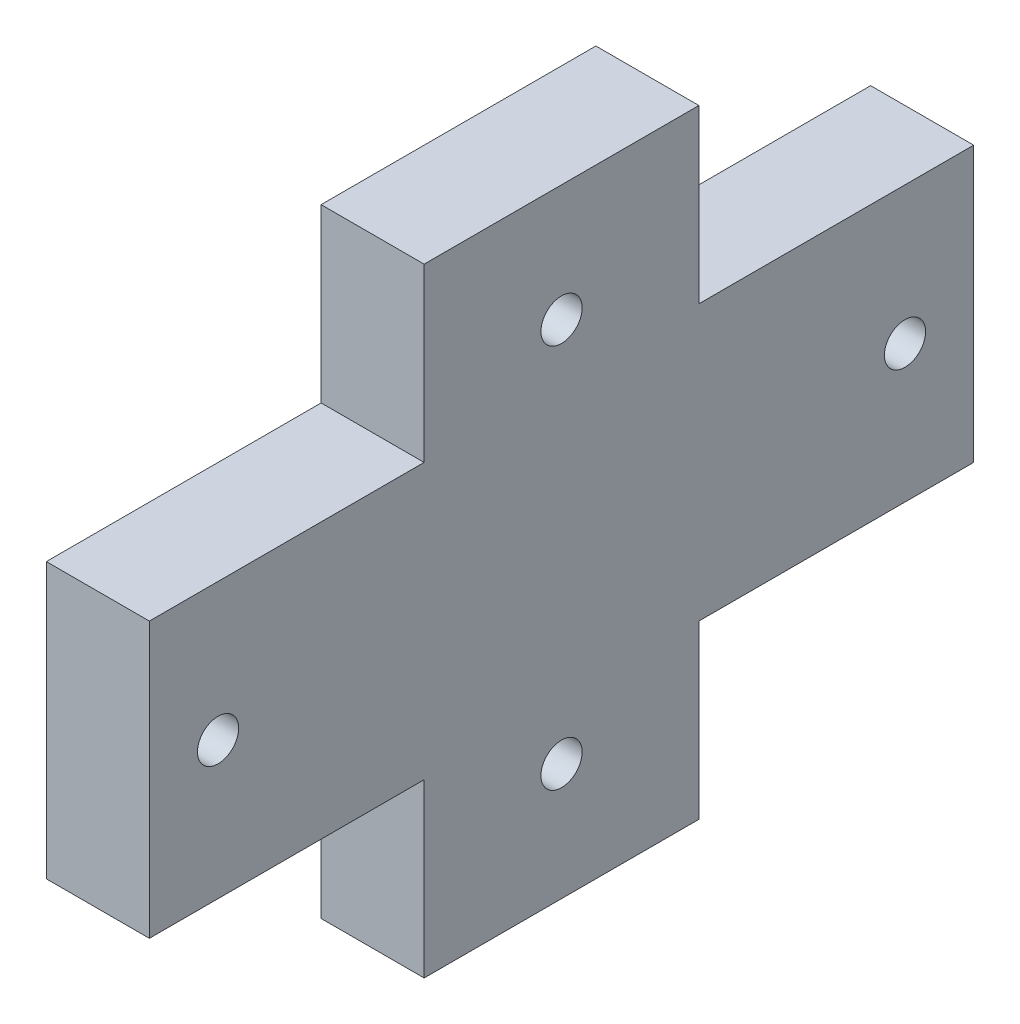
ISO-10303-21;
HEADER;
FILE_DESCRIPTION(('STEP AP214'),'2;1');
FILE_NAME('part.step','',(''),(''),'','','');
FILE_SCHEMA(('AUTOMOTIVE_DESIGN { 1 0 10303 214 1 1 1 1 }'));
ENDSEC;
DATA;
#1=APPLICATION_CONTEXT('core data for automotive mechanical design processes');
#2=APPLICATION_PROTOCOL_DEFINITION('international standard','automotive_design',2000,#1);
#3=PRODUCT_CONTEXT('',#1,'mechanical');
#4=PRODUCT('Part','Part','',(#3));
#5=PRODUCT_RELATED_PRODUCT_CATEGORY('part','',(#4));
#6=PRODUCT_DEFINITION_FORMATION('','',#4);
#7=PRODUCT_DEFINITION_CONTEXT('part definition',#1,'design');
#8=PRODUCT_DEFINITION('design','',#6,#7);
#9=PRODUCT_DEFINITION_SHAPE('','',#8);
#10=(LENGTH_UNIT() NAMED_UNIT(*) SI_UNIT(.MILLI.,.METRE.));
#11=(NAMED_UNIT(*) PLANE_ANGLE_UNIT() SI_UNIT($,.RADIAN.));
#12=(NAMED_UNIT(*) SI_UNIT($,.STERADIAN.) SOLID_ANGLE_UNIT());
#13=UNCERTAINTY_MEASURE_WITH_UNIT(LENGTH_MEASURE(1.E-05),#10,'distance_accuracy_value','');
#14=(GEOMETRIC_REPRESENTATION_CONTEXT(3) GLOBAL_UNCERTAINTY_ASSIGNED_CONTEXT((#13)) GLOBAL_UNIT_ASSIGNED_CONTEXT((#10,
#11,#12)) REPRESENTATION_CONTEXT('',''));
#15=CARTESIAN_POINT('',(0.,0.,0.));
#16=DIRECTION('',(0.,0.,1.));
#17=DIRECTION('',(1.,0.,0.));
#18=AXIS2_PLACEMENT_3D('',#15,#16,#17);
#19=CARTESIAN_POINT('',(200.,0.,0.));
#20=DIRECTION('',(-1.,0.,0.));
#21=DIRECTION('',(0.,0.,1.));
#22=AXIS2_PLACEMENT_3D('',#19,#20,#21);
#23=PLANE('',#22);
#24=CARTESIAN_POINT('',(200.,38.,0.));
#25=DIRECTION('',(1.,0.,0.));
#26=DIRECTION('',(0.,0.,1.));
#27=AXIS2_PLACEMENT_3D('',#24,#25,#26);
#28=CIRCLE('',#27,7.5);
#29=CARTESIAN_POINT('',(200.,38.,7.5));
#30=VERTEX_POINT('',#29);
#31=EDGE_CURVE('E214',#30,#30,#28,.T.);
#32=ORIENTED_EDGE('',*,*,#31,.T.);
#33=EDGE_LOOP('',(#32));
#34=FACE_BOUND('',#33,.T.);
#35=CARTESIAN_POINT('',(200.,10.,50.));
#36=DIRECTION('',(1.,0.,0.));
#37=DIRECTION('',(0.,0.,-1.));
#38=AXIS2_PLACEMENT_3D('',#35,#36,#37);
#39=CIRCLE('',#38,7.5);
#40=CARTESIAN_POINT('',(200.,10.,42.5));
#41=VERTEX_POINT('',#40);
#42=EDGE_CURVE('E202',#41,#41,#39,.T.);
#43=ORIENTED_EDGE('',*,*,#42,.T.);
#44=EDGE_LOOP('',(#43));
#45=FACE_BOUND('',#44,.T.);
#46=CARTESIAN_POINT('',(200.,10.,-50.));
#47=DIRECTION('',(-1.,0.,0.));
#48=DIRECTION('',(0.,0.,1.));
#49=AXIS2_PLACEMENT_3D('',#46,#47,#48);
#50=CIRCLE('',#49,7.5);
#51=CARTESIAN_POINT('',(200.,10.,-42.5));
#52=VERTEX_POINT('',#51);
#53=EDGE_CURVE('E190',#52,#52,#50,.T.);
#54=ORIENTED_EDGE('',*,*,#53,.F.);
#55=EDGE_LOOP('',(#54));
#56=FACE_BOUND('',#55,.T.);
#57=CARTESIAN_POINT('',(200.,-18.,0.));
#58=DIRECTION('',(-1.,0.,0.));
#59=DIRECTION('',(0.,0.,1.));
#60=AXIS2_PLACEMENT_3D('',#57,#58,#59);
#61=CIRCLE('',#60,7.5);
#62=CARTESIAN_POINT('',(200.,-18.,7.5));
#63=VERTEX_POINT('',#62);
#64=EDGE_CURVE('E178',#63,#63,#61,.T.);
#65=ORIENTED_EDGE('',*,*,#64,.F.);
#66=EDGE_LOOP('',(#65));
#67=FACE_BOUND('',#66,.T.);
#68=DIRECTION('',(0.,-1.,0.));
#69=VECTOR('',#68,1.);
#70=CARTESIAN_POINT('',(200.,20.,60.));
#71=LINE('',#70,#69);
#72=CARTESIAN_POINT('',(200.,30.,60.));
#73=VERTEX_POINT('',#72);
#74=CARTESIAN_POINT('',(200.,-10.,60.));
#75=VERTEX_POINT('',#74);
#76=EDGE_CURVE('E291',#73,#75,#71,.T.);
#77=ORIENTED_EDGE('',*,*,#76,.F.);
#78=DIRECTION('',(0.,0.,-1.));
#79=VECTOR('',#78,1.);
#80=CARTESIAN_POINT('',(200.,30.,60.));
#81=LINE('',#80,#79);
#82=CARTESIAN_POINT('',(200.,30.,20.));
#83=VERTEX_POINT('',#82);
#84=EDGE_CURVE('E161',#73,#83,#81,.T.);
#85=ORIENTED_EDGE('',*,*,#84,.T.);
#86=DIRECTION('',(0.,-1.,0.));
#87=VECTOR('',#86,1.);
#88=CARTESIAN_POINT('',(200.,55.,20.));
#89=LINE('',#88,#87);
#90=CARTESIAN_POINT('',(200.,55.,20.));
#91=VERTEX_POINT('',#90);
#92=EDGE_CURVE('E165',#91,#83,#89,.T.);
#93=ORIENTED_EDGE('',*,*,#92,.F.);
#94=DIRECTION('',(0.,0.,-1.));
#95=VECTOR('',#94,1.);
#96=CARTESIAN_POINT('',(200.,55.,20.));
#97=LINE('',#96,#95);
#98=CARTESIAN_POINT('',(200.,55.,-20.));
#99=VERTEX_POINT('',#98);
#100=EDGE_CURVE('E174',#91,#99,#97,.T.);
#101=ORIENTED_EDGE('',*,*,#100,.T.);
#102=DIRECTION('',(0.,-1.,0.));
#103=VECTOR('',#102,1.);
#104=CARTESIAN_POINT('',(200.,55.,-20.));
#105=LINE('',#104,#103);
#106=CARTESIAN_POINT('',(200.,30.,-20.));
#107=VERTEX_POINT('',#106);
#108=EDGE_CURVE('E56',#99,#107,#105,.T.);
#109=ORIENTED_EDGE('',*,*,#108,.T.);
#110=CARTESIAN_POINT('',(200.,30.,-60.));
#111=VERTEX_POINT('',#110);
#112=EDGE_CURVE('E136',#107,#111,#81,.T.);
#113=ORIENTED_EDGE('',*,*,#112,.T.);
#114=DIRECTION('',(0.,-1.,0.));
#115=VECTOR('',#114,1.);
#116=CARTESIAN_POINT('',(200.,20.,-60.));
#117=LINE('',#116,#115);
#118=CARTESIAN_POINT('',(200.,-10.,-60.));
#119=VERTEX_POINT('',#118);
#120=EDGE_CURVE('E299',#111,#119,#117,.T.);
#121=ORIENTED_EDGE('',*,*,#120,.T.);
#122=DIRECTION('',(0.,0.,-1.));
#123=VECTOR('',#122,1.);
#124=CARTESIAN_POINT('',(200.,-10.,60.));
#125=LINE('',#124,#123);
#126=CARTESIAN_POINT('',(200.,-10.,-20.));
#127=VERTEX_POINT('',#126);
#128=EDGE_CURVE('E320',#127,#119,#125,.T.);
#129=ORIENTED_EDGE('',*,*,#128,.F.);
#130=DIRECTION('',(0.,1.,0.));
#131=VECTOR('',#130,1.);
#132=CARTESIAN_POINT('',(200.,-35.,-20.));
#133=LINE('',#132,#131);
#134=CARTESIAN_POINT('',(200.,-35.,-20.));
#135=VERTEX_POINT('',#134);
#136=EDGE_CURVE('E326',#135,#127,#133,.T.);
#137=ORIENTED_EDGE('',*,*,#136,.F.);
#138=DIRECTION('',(0.,0.,-1.));
#139=VECTOR('',#138,1.);
#140=CARTESIAN_POINT('',(200.,-35.,20.));
#141=LINE('',#140,#139);
#142=CARTESIAN_POINT('',(200.,-35.,20.));
#143=VERTEX_POINT('',#142);
#144=EDGE_CURVE('E340',#143,#135,#141,.T.);
#145=ORIENTED_EDGE('',*,*,#144,.F.);
#146=DIRECTION('',(0.,1.,0.));
#147=VECTOR('',#146,1.);
#148=CARTESIAN_POINT('',(200.,-35.,20.));
#149=LINE('',#148,#147);
#150=CARTESIAN_POINT('',(200.,-10.,20.));
#151=VERTEX_POINT('',#150);
#152=EDGE_CURVE('E324',#143,#151,#149,.T.);
#153=ORIENTED_EDGE('',*,*,#152,.T.);
#154=EDGE_CURVE('E294',#75,#151,#125,.T.);
#155=ORIENTED_EDGE('',*,*,#154,.F.);
#156=EDGE_LOOP('',(#77,#85,#93,#101,#109,#113,#121,#129,#137,#145,#153,#155));
#157=FACE_BOUND('',#156,.T.);
#158=ADVANCED_FACE('F40',(#34,#45,#56,#67,#157),#23,.T.);
#159=CARTESIAN_POINT('',(215.,-18.,0.));
#160=DIRECTION('',(-1.,0.,0.));
#161=DIRECTION('',(0.,0.,1.));
#162=AXIS2_PLACEMENT_3D('',#159,#160,#161);
#163=CYLINDRICAL_SURFACE('',#162,3.);
#164=CARTESIAN_POINT('',(215.,-18.,0.));
#165=DIRECTION('',(-1.,0.,0.));
#166=DIRECTION('',(0.,0.,1.));
#167=AXIS2_PLACEMENT_3D('',#164,#165,#166);
#168=CIRCLE('',#167,3.);
#169=CARTESIAN_POINT('',(215.,-18.,3.));
#170=VERTEX_POINT('',#169);
#171=EDGE_CURVE('E181',#170,#170,#168,.T.);
#172=ORIENTED_EDGE('',*,*,#171,.F.);
#173=EDGE_LOOP('',(#172));
#174=FACE_BOUND('',#173,.T.);
#175=CARTESIAN_POINT('',(202.,-18.,0.));
#176=DIRECTION('',(-1.,0.,0.));
#177=DIRECTION('',(0.,0.,1.));
#178=AXIS2_PLACEMENT_3D('',#175,#176,#177);
#179=CIRCLE('',#178,3.);
#180=CARTESIAN_POINT('',(202.,-18.,3.));
#181=VERTEX_POINT('',#180);
#182=EDGE_CURVE('E184',#181,#181,#179,.T.);
#183=ORIENTED_EDGE('',*,*,#182,.T.);
#184=EDGE_LOOP('',(#183));
#185=FACE_BOUND('',#184,.T.);
#186=ADVANCED_FACE('F236',(#174,#185),#163,.F.);
#187=CARTESIAN_POINT('',(202.,-18.,0.));
#188=DIRECTION('',(-1.,0.,0.));
#189=DIRECTION('',(0.,0.,1.));
#190=AXIS2_PLACEMENT_3D('',#187,#188,#189);
#191=PLANE('',#190);
#192=ORIENTED_EDGE('',*,*,#182,.F.);
#193=EDGE_LOOP('',(#192));
#194=FACE_BOUND('',#193,.T.);
#195=CARTESIAN_POINT('',(202.,-18.,0.));
#196=DIRECTION('',(-1.,0.,0.));
#197=DIRECTION('',(0.,0.,1.));
#198=AXIS2_PLACEMENT_3D('',#195,#196,#197);
#199=CIRCLE('',#198,7.5);
#200=CARTESIAN_POINT('',(202.,-18.,7.5));
#201=VERTEX_POINT('',#200);
#202=EDGE_CURVE('E144',#201,#201,#199,.T.);
#203=ORIENTED_EDGE('',*,*,#202,.T.);
#204=EDGE_LOOP('',(#203));
#205=FACE_BOUND('',#204,.T.);
#206=ADVANCED_FACE('F238',(#194,#205),#191,.T.);
#207=CARTESIAN_POINT('',(202.,-18.,0.));
#208=DIRECTION('',(-1.,0.,0.));
#209=DIRECTION('',(0.,0.,1.));
#210=AXIS2_PLACEMENT_3D('',#207,#208,#209);
#211=CYLINDRICAL_SURFACE('',#210,7.5);
#212=ORIENTED_EDGE('',*,*,#202,.F.);
#213=EDGE_LOOP('',(#212));
#214=FACE_BOUND('',#213,.T.);
#215=ORIENTED_EDGE('',*,*,#64,.T.);
#216=EDGE_LOOP('',(#215));
#217=FACE_BOUND('',#216,.T.);
#218=ADVANCED_FACE('F245',(#214,#217),#211,.F.);
#219=CARTESIAN_POINT('',(215.,10.,-50.));
#220=DIRECTION('',(-1.,0.,0.));
#221=DIRECTION('',(0.,0.,1.));
#222=AXIS2_PLACEMENT_3D('',#219,#220,#221);
#223=CYLINDRICAL_SURFACE('',#222,3.);
#224=CARTESIAN_POINT('',(215.,10.,-50.));
#225=DIRECTION('',(-1.,0.,0.));
#226=DIRECTION('',(0.,0.,1.));
#227=AXIS2_PLACEMENT_3D('',#224,#225,#226);
#228=CIRCLE('',#227,3.);
#229=CARTESIAN_POINT('',(215.,10.,-47.));
#230=VERTEX_POINT('',#229);
#231=EDGE_CURVE('E193',#230,#230,#228,.T.);
#232=ORIENTED_EDGE('',*,*,#231,.F.);
#233=EDGE_LOOP('',(#232));
#234=FACE_BOUND('',#233,.T.);
#235=CARTESIAN_POINT('',(202.,10.,-50.));
#236=DIRECTION('',(-1.,0.,0.));
#237=DIRECTION('',(0.,0.,1.));
#238=AXIS2_PLACEMENT_3D('',#235,#236,#237);
#239=CIRCLE('',#238,3.);
#240=CARTESIAN_POINT('',(202.,10.,-47.));
#241=VERTEX_POINT('',#240);
#242=EDGE_CURVE('E196',#241,#241,#239,.T.);
#243=ORIENTED_EDGE('',*,*,#242,.T.);
#244=EDGE_LOOP('',(#243));
#245=FACE_BOUND('',#244,.T.);
#246=ADVANCED_FACE('F262',(#234,#245),#223,.F.);
#247=CARTESIAN_POINT('',(202.,10.,-50.));
#248=DIRECTION('',(-1.,0.,0.));
#249=DIRECTION('',(0.,0.,1.));
#250=AXIS2_PLACEMENT_3D('',#247,#248,#249);
#251=PLANE('',#250);
#252=ORIENTED_EDGE('',*,*,#242,.F.);
#253=EDGE_LOOP('',(#252));
#254=FACE_BOUND('',#253,.T.);
#255=CARTESIAN_POINT('',(202.,10.,-50.));
#256=DIRECTION('',(-1.,0.,0.));
#257=DIRECTION('',(0.,0.,1.));
#258=AXIS2_PLACEMENT_3D('',#255,#256,#257);
#259=CIRCLE('',#258,7.5);
#260=CARTESIAN_POINT('',(202.,10.,-42.5));
#261=VERTEX_POINT('',#260);
#262=EDGE_CURVE('E187',#261,#261,#259,.T.);
#263=ORIENTED_EDGE('',*,*,#262,.T.);
#264=EDGE_LOOP('',(#263));
#265=FACE_BOUND('',#264,.T.);
#266=ADVANCED_FACE('F258',(#254,#265),#251,.T.);
#267=CARTESIAN_POINT('',(202.,10.,-50.));
#268=DIRECTION('',(-1.,0.,0.));
#269=DIRECTION('',(0.,0.,1.));
#270=AXIS2_PLACEMENT_3D('',#267,#268,#269);
#271=CYLINDRICAL_SURFACE('',#270,7.5);
#272=ORIENTED_EDGE('',*,*,#262,.F.);
#273=EDGE_LOOP('',(#272));
#274=FACE_BOUND('',#273,.T.);
#275=ORIENTED_EDGE('',*,*,#53,.T.);
#276=EDGE_LOOP('',(#275));
#277=FACE_BOUND('',#276,.T.);
#278=ADVANCED_FACE('F254',(#274,#277),#271,.F.);
#279=CARTESIAN_POINT('',(215.,10.,50.));
#280=DIRECTION('',(-1.,0.,0.));
#281=DIRECTION('',(0.,0.,1.));
#282=AXIS2_PLACEMENT_3D('',#279,#280,#281);
#283=CYLINDRICAL_SURFACE('',#282,3.);
#284=CARTESIAN_POINT('',(215.,10.,50.));
#285=DIRECTION('',(1.,0.,0.));
#286=DIRECTION('',(0.,0.,-1.));
#287=AXIS2_PLACEMENT_3D('',#284,#285,#286);
#288=CIRCLE('',#287,3.);
#289=CARTESIAN_POINT('',(215.,10.,47.));
#290=VERTEX_POINT('',#289);
#291=EDGE_CURVE('E205',#290,#290,#288,.T.);
#292=ORIENTED_EDGE('',*,*,#291,.T.);
#293=EDGE_LOOP('',(#292));
#294=FACE_BOUND('',#293,.T.);
#295=CARTESIAN_POINT('',(202.,10.,50.));
#296=DIRECTION('',(1.,0.,0.));
#297=DIRECTION('',(0.,0.,-1.));
#298=AXIS2_PLACEMENT_3D('',#295,#296,#297);
#299=CIRCLE('',#298,3.);
#300=CARTESIAN_POINT('',(202.,10.,47.));
#301=VERTEX_POINT('',#300);
#302=EDGE_CURVE('E208',#301,#301,#299,.T.);
#303=ORIENTED_EDGE('',*,*,#302,.F.);
#304=EDGE_LOOP('',(#303));
#305=FACE_BOUND('',#304,.T.);
#306=ADVANCED_FACE('F257',(#294,#305),#283,.F.);
#307=CARTESIAN_POINT('',(202.,10.,50.));
#308=DIRECTION('',(-1.,0.,0.));
#309=DIRECTION('',(0.,0.,-1.));
#310=AXIS2_PLACEMENT_3D('',#307,#308,#309);
#311=PLANE('',#310);
#312=ORIENTED_EDGE('',*,*,#302,.T.);
#313=EDGE_LOOP('',(#312));
#314=FACE_BOUND('',#313,.T.);
#315=CARTESIAN_POINT('',(202.,10.,50.));
#316=DIRECTION('',(1.,0.,0.));
#317=DIRECTION('',(0.,0.,-1.));
#318=AXIS2_PLACEMENT_3D('',#315,#316,#317);
#319=CIRCLE('',#318,7.5);
#320=CARTESIAN_POINT('',(202.,10.,42.5));
#321=VERTEX_POINT('',#320);
#322=EDGE_CURVE('E199',#321,#321,#319,.T.);
#323=ORIENTED_EDGE('',*,*,#322,.F.);
#324=EDGE_LOOP('',(#323));
#325=FACE_BOUND('',#324,.T.);
#326=ADVANCED_FACE('F269',(#314,#325),#311,.T.);
#327=CARTESIAN_POINT('',(202.,10.,50.));
#328=DIRECTION('',(-1.,0.,0.));
#329=DIRECTION('',(0.,0.,1.));
#330=AXIS2_PLACEMENT_3D('',#327,#328,#329);
#331=CYLINDRICAL_SURFACE('',#330,7.5);
#332=ORIENTED_EDGE('',*,*,#322,.T.);
#333=EDGE_LOOP('',(#332));
#334=FACE_BOUND('',#333,.T.);
#335=ORIENTED_EDGE('',*,*,#42,.F.);
#336=EDGE_LOOP('',(#335));
#337=FACE_BOUND('',#336,.T.);
#338=ADVANCED_FACE('F234',(#334,#337),#331,.F.);
#339=CARTESIAN_POINT('',(215.,38.,0.));
#340=DIRECTION('',(-1.,0.,0.));
#341=DIRECTION('',(0.,0.,1.));
#342=AXIS2_PLACEMENT_3D('',#339,#340,#341);
#343=CYLINDRICAL_SURFACE('',#342,3.);
#344=CARTESIAN_POINT('',(215.,38.,0.));
#345=DIRECTION('',(1.,0.,0.));
#346=DIRECTION('',(0.,0.,1.));
#347=AXIS2_PLACEMENT_3D('',#344,#345,#346);
#348=CIRCLE('',#347,3.);
#349=CARTESIAN_POINT('',(215.,38.,3.));
#350=VERTEX_POINT('',#349);
#351=EDGE_CURVE('E43',#350,#350,#348,.T.);
#352=ORIENTED_EDGE('',*,*,#351,.T.);
#353=EDGE_LOOP('',(#352));
#354=FACE_BOUND('',#353,.T.);
#355=CARTESIAN_POINT('',(202.,38.,0.));
#356=DIRECTION('',(1.,0.,0.));
#357=DIRECTION('',(0.,0.,1.));
#358=AXIS2_PLACEMENT_3D('',#355,#356,#357);
#359=CIRCLE('',#358,3.);
#360=CARTESIAN_POINT('',(202.,38.,3.));
#361=VERTEX_POINT('',#360);
#362=EDGE_CURVE('E11',#361,#361,#359,.T.);
#363=ORIENTED_EDGE('',*,*,#362,.F.);
#364=EDGE_LOOP('',(#363));
#365=FACE_BOUND('',#364,.T.);
#366=ADVANCED_FACE('F225',(#354,#365),#343,.F.);
#367=CARTESIAN_POINT('',(202.,38.,0.));
#368=DIRECTION('',(-1.,0.,0.));
#369=DIRECTION('',(0.,0.,1.));
#370=AXIS2_PLACEMENT_3D('',#367,#368,#369);
#371=PLANE('',#370);
#372=ORIENTED_EDGE('',*,*,#362,.T.);
#373=EDGE_LOOP('',(#372));
#374=FACE_BOUND('',#373,.T.);
#375=CARTESIAN_POINT('',(202.,38.,0.));
#376=DIRECTION('',(1.,0.,0.));
#377=DIRECTION('',(0.,0.,1.));
#378=AXIS2_PLACEMENT_3D('',#375,#376,#377);
#379=CIRCLE('',#378,7.5);
#380=CARTESIAN_POINT('',(202.,38.,7.5));
#381=VERTEX_POINT('',#380);
#382=EDGE_CURVE('E211',#381,#381,#379,.T.);
#383=ORIENTED_EDGE('',*,*,#382,.F.);
#384=EDGE_LOOP('',(#383));
#385=FACE_BOUND('',#384,.T.);
#386=ADVANCED_FACE('F223',(#374,#385),#371,.T.);
#387=CARTESIAN_POINT('',(202.,38.,0.));
#388=DIRECTION('',(-1.,0.,0.));
#389=DIRECTION('',(0.,0.,1.));
#390=AXIS2_PLACEMENT_3D('',#387,#388,#389);
#391=CYLINDRICAL_SURFACE('',#390,7.5);
#392=ORIENTED_EDGE('',*,*,#382,.T.);
#393=EDGE_LOOP('',(#392));
#394=FACE_BOUND('',#393,.T.);
#395=ORIENTED_EDGE('',*,*,#31,.F.);
#396=EDGE_LOOP('',(#395));
#397=FACE_BOUND('',#396,.T.);
#398=ADVANCED_FACE('F220',(#394,#397),#391,.F.);
#399=CARTESIAN_POINT('',(200.,20.,-60.));
#400=DIRECTION('',(0.,0.,1.));
#401=DIRECTION('',(1.,0.,0.));
#402=AXIS2_PLACEMENT_3D('',#399,#400,#401);
#403=PLANE('',#402);
#404=DIRECTION('',(0.,-1.,0.));
#405=VECTOR('',#404,1.);
#406=CARTESIAN_POINT('',(215.,20.,-60.));
#407=LINE('',#406,#405);
#408=CARTESIAN_POINT('',(215.,30.,-60.));
#409=VERTEX_POINT('',#408);
#410=CARTESIAN_POINT('',(215.,-10.,-60.));
#411=VERTEX_POINT('',#410);
#412=EDGE_CURVE('E150',#409,#411,#407,.T.);
#413=ORIENTED_EDGE('',*,*,#412,.T.);
#414=DIRECTION('',(1.,0.,0.));
#415=VECTOR('',#414,1.);
#416=CARTESIAN_POINT('',(200.,-10.,-60.));
#417=LINE('',#416,#415);
#418=EDGE_CURVE('E316',#119,#411,#417,.T.);
#419=ORIENTED_EDGE('',*,*,#418,.F.);
#420=ORIENTED_EDGE('',*,*,#120,.F.);
#421=DIRECTION('',(1.,0.,0.));
#422=VECTOR('',#421,1.);
#423=CARTESIAN_POINT('',(200.,30.,-60.));
#424=LINE('',#423,#422);
#425=EDGE_CURVE('E152',#111,#409,#424,.T.);
#426=ORIENTED_EDGE('',*,*,#425,.T.);
#427=EDGE_LOOP('',(#413,#419,#420,#426));
#428=FACE_BOUND('',#427,.T.);
#429=ADVANCED_FACE('F232',(#428),#403,.F.);
#430=CARTESIAN_POINT('',(200.,20.,60.));
#431=DIRECTION('',(0.,0.,1.));
#432=DIRECTION('',(1.,0.,0.));
#433=AXIS2_PLACEMENT_3D('',#430,#431,#432);
#434=PLANE('',#433);
#435=ORIENTED_EDGE('',*,*,#76,.T.);
#436=DIRECTION('',(-1.,0.,0.));
#437=VECTOR('',#436,1.);
#438=CARTESIAN_POINT('',(200.,-10.,60.));
#439=LINE('',#438,#437);
#440=CARTESIAN_POINT('',(215.,-10.,60.));
#441=VERTEX_POINT('',#440);
#442=EDGE_CURVE('E307',#441,#75,#439,.T.);
#443=ORIENTED_EDGE('',*,*,#442,.F.);
#444=DIRECTION('',(0.,-1.,0.));
#445=VECTOR('',#444,1.);
#446=CARTESIAN_POINT('',(215.,20.,60.));
#447=LINE('',#446,#445);
#448=CARTESIAN_POINT('',(215.,30.,60.));
#449=VERTEX_POINT('',#448);
#450=EDGE_CURVE('E298',#449,#441,#447,.T.);
#451=ORIENTED_EDGE('',*,*,#450,.F.);
#452=DIRECTION('',(-1.,0.,0.));
#453=VECTOR('',#452,1.);
#454=CARTESIAN_POINT('',(200.,30.,60.));
#455=LINE('',#454,#453);
#456=EDGE_CURVE('E154',#449,#73,#455,.T.);
#457=ORIENTED_EDGE('',*,*,#456,.T.);
#458=EDGE_LOOP('',(#435,#443,#451,#457));
#459=FACE_BOUND('',#458,.T.);
#460=ADVANCED_FACE('F306',(#459),#434,.T.);
#461=CARTESIAN_POINT('',(0.,-10.,0.));
#462=DIRECTION('',(0.,-1.,0.));
#463=DIRECTION('',(0.,0.,-1.));
#464=AXIS2_PLACEMENT_3D('',#461,#462,#463);
#465=PLANE('',#464);
#466=DIRECTION('',(-1.,0.,0.));
#467=VECTOR('',#466,1.);
#468=CARTESIAN_POINT('',(200.,-10.,20.));
#469=LINE('',#468,#467);
#470=CARTESIAN_POINT('',(215.,-10.,20.));
#471=VERTEX_POINT('',#470);
#472=EDGE_CURVE('E155',#471,#151,#469,.T.);
#473=ORIENTED_EDGE('',*,*,#472,.F.);
#474=DIRECTION('',(0.,0.,1.));
#475=VECTOR('',#474,1.);
#476=CARTESIAN_POINT('',(215.,-10.,60.));
#477=LINE('',#476,#475);
#478=EDGE_CURVE('E315',#471,#441,#477,.T.);
#479=ORIENTED_EDGE('',*,*,#478,.T.);
#480=ORIENTED_EDGE('',*,*,#442,.T.);
#481=ORIENTED_EDGE('',*,*,#154,.T.);
#482=EDGE_LOOP('',(#473,#479,#480,#481));
#483=FACE_BOUND('',#482,.T.);
#484=ADVANCED_FACE('F369',(#483),#465,.T.);
#485=DIRECTION('',(1.,0.,0.));
#486=VECTOR('',#485,1.);
#487=CARTESIAN_POINT('',(200.,-10.,-20.));
#488=LINE('',#487,#486);
#489=CARTESIAN_POINT('',(215.,-10.,-20.));
#490=VERTEX_POINT('',#489);
#491=EDGE_CURVE('E333',#127,#490,#488,.T.);
#492=ORIENTED_EDGE('',*,*,#491,.F.);
#493=ORIENTED_EDGE('',*,*,#128,.T.);
#494=ORIENTED_EDGE('',*,*,#418,.T.);
#495=EDGE_CURVE('E310',#411,#490,#477,.T.);
#496=ORIENTED_EDGE('',*,*,#495,.T.);
#497=EDGE_LOOP('',(#492,#493,#494,#496));
#498=FACE_BOUND('',#497,.T.);
#499=ADVANCED_FACE('F359',(#498),#465,.T.);
#500=CARTESIAN_POINT('',(200.,-35.,-20.));
#501=DIRECTION('',(0.,0.,1.));
#502=DIRECTION('',(1.,0.,0.));
#503=AXIS2_PLACEMENT_3D('',#500,#501,#502);
#504=PLANE('',#503);
#505=ORIENTED_EDGE('',*,*,#491,.T.);
#506=DIRECTION('',(0.,1.,0.));
#507=VECTOR('',#506,1.);
#508=CARTESIAN_POINT('',(215.,-35.,-20.));
#509=LINE('',#508,#507);
#510=CARTESIAN_POINT('',(215.,-35.,-20.));
#511=VERTEX_POINT('',#510);
#512=EDGE_CURVE('E329',#511,#490,#509,.T.);
#513=ORIENTED_EDGE('',*,*,#512,.F.);
#514=DIRECTION('',(1.,0.,0.));
#515=VECTOR('',#514,1.);
#516=CARTESIAN_POINT('',(200.,-35.,-20.));
#517=LINE('',#516,#515);
#518=EDGE_CURVE('E332',#135,#511,#517,.T.);
#519=ORIENTED_EDGE('',*,*,#518,.F.);
#520=ORIENTED_EDGE('',*,*,#136,.T.);
#521=EDGE_LOOP('',(#505,#513,#519,#520));
#522=FACE_BOUND('',#521,.T.);
#523=ADVANCED_FACE('F357',(#522),#504,.F.);
#524=CARTESIAN_POINT('',(200.,-35.,20.));
#525=DIRECTION('',(0.,0.,-1.));
#526=DIRECTION('',(-1.,0.,0.));
#527=AXIS2_PLACEMENT_3D('',#524,#525,#526);
#528=PLANE('',#527);
#529=ORIENTED_EDGE('',*,*,#472,.T.);
#530=ORIENTED_EDGE('',*,*,#152,.F.);
#531=DIRECTION('',(-1.,0.,0.));
#532=VECTOR('',#531,1.);
#533=CARTESIAN_POINT('',(200.,-35.,20.));
#534=LINE('',#533,#532);
#535=CARTESIAN_POINT('',(215.,-35.,20.));
#536=VERTEX_POINT('',#535);
#537=EDGE_CURVE('E342',#536,#143,#534,.T.);
#538=ORIENTED_EDGE('',*,*,#537,.F.);
#539=DIRECTION('',(0.,1.,0.));
#540=VECTOR('',#539,1.);
#541=CARTESIAN_POINT('',(215.,-35.,20.));
#542=LINE('',#541,#540);
#543=EDGE_CURVE('E321',#536,#471,#542,.T.);
#544=ORIENTED_EDGE('',*,*,#543,.T.);
#545=EDGE_LOOP('',(#529,#530,#538,#544));
#546=FACE_BOUND('',#545,.T.);
#547=ADVANCED_FACE('F351',(#546),#528,.F.);
#548=CARTESIAN_POINT('',(0.,30.,0.));
#549=DIRECTION('',(0.,1.,0.));
#550=DIRECTION('',(0.,0.,-1.));
#551=AXIS2_PLACEMENT_3D('',#548,#549,#550);
#552=PLANE('',#551);
#553=ORIENTED_EDGE('',*,*,#112,.F.);
#554=DIRECTION('',(1.,0.,0.));
#555=VECTOR('',#554,1.);
#556=CARTESIAN_POINT('',(200.,30.,-20.));
#557=LINE('',#556,#555);
#558=CARTESIAN_POINT('',(215.,30.,-20.));
#559=VERTEX_POINT('',#558);
#560=EDGE_CURVE('E133',#107,#559,#557,.T.);
#561=ORIENTED_EDGE('',*,*,#560,.T.);
#562=DIRECTION('',(0.,0.,1.));
#563=VECTOR('',#562,1.);
#564=CARTESIAN_POINT('',(215.,30.,60.));
#565=LINE('',#564,#563);
#566=EDGE_CURVE('E142',#409,#559,#565,.T.);
#567=ORIENTED_EDGE('',*,*,#566,.F.);
#568=ORIENTED_EDGE('',*,*,#425,.F.);
#569=EDGE_LOOP('',(#553,#561,#567,#568));
#570=FACE_BOUND('',#569,.T.);
#571=ADVANCED_FACE('F140',(#570),#552,.T.);
#572=CARTESIAN_POINT('',(215.,30.,20.));
#573=VERTEX_POINT('',#572);
#574=EDGE_CURVE('E151',#573,#449,#565,.T.);
#575=ORIENTED_EDGE('',*,*,#574,.F.);
#576=DIRECTION('',(-1.,0.,0.));
#577=VECTOR('',#576,1.);
#578=CARTESIAN_POINT('',(200.,30.,20.));
#579=LINE('',#578,#577);
#580=EDGE_CURVE('E145',#573,#83,#579,.T.);
#581=ORIENTED_EDGE('',*,*,#580,.T.);
#582=ORIENTED_EDGE('',*,*,#84,.F.);
#583=ORIENTED_EDGE('',*,*,#456,.F.);
#584=EDGE_LOOP('',(#575,#581,#582,#583));
#585=FACE_BOUND('',#584,.T.);
#586=ADVANCED_FACE('F304',(#585),#552,.T.);
#587=CARTESIAN_POINT('',(200.,55.,20.));
#588=DIRECTION('',(0.,0.,1.));
#589=DIRECTION('',(1.,0.,0.));
#590=AXIS2_PLACEMENT_3D('',#587,#588,#589);
#591=PLANE('',#590);
#592=ORIENTED_EDGE('',*,*,#580,.F.);
#593=DIRECTION('',(0.,-1.,0.));
#594=VECTOR('',#593,1.);
#595=CARTESIAN_POINT('',(215.,55.,20.));
#596=LINE('',#595,#594);
#597=CARTESIAN_POINT('',(215.,55.,20.));
#598=VERTEX_POINT('',#597);
#599=EDGE_CURVE('E82',#598,#573,#596,.T.);
#600=ORIENTED_EDGE('',*,*,#599,.F.);
#601=DIRECTION('',(-1.,0.,0.));
#602=VECTOR('',#601,1.);
#603=CARTESIAN_POINT('',(200.,55.,20.));
#604=LINE('',#603,#602);
#605=EDGE_CURVE('E168',#598,#91,#604,.T.);
#606=ORIENTED_EDGE('',*,*,#605,.T.);
#607=ORIENTED_EDGE('',*,*,#92,.T.);
#608=EDGE_LOOP('',(#592,#600,#606,#607));
#609=FACE_BOUND('',#608,.T.);
#610=ADVANCED_FACE('F385',(#609),#591,.T.);
#611=CARTESIAN_POINT('',(200.,55.,-20.));
#612=DIRECTION('',(0.,0.,-1.));
#613=DIRECTION('',(-1.,0.,0.));
#614=AXIS2_PLACEMENT_3D('',#611,#612,#613);
#615=PLANE('',#614);
#616=ORIENTED_EDGE('',*,*,#560,.F.);
#617=ORIENTED_EDGE('',*,*,#108,.F.);
#618=DIRECTION('',(1.,0.,0.));
#619=VECTOR('',#618,1.);
#620=CARTESIAN_POINT('',(200.,55.,-20.));
#621=LINE('',#620,#619);
#622=CARTESIAN_POINT('',(215.,55.,-20.));
#623=VERTEX_POINT('',#622);
#624=EDGE_CURVE('E135',#99,#623,#621,.T.);
#625=ORIENTED_EDGE('',*,*,#624,.T.);
#626=DIRECTION('',(0.,-1.,0.));
#627=VECTOR('',#626,1.);
#628=CARTESIAN_POINT('',(215.,55.,-20.));
#629=LINE('',#628,#627);
#630=EDGE_CURVE('E78',#623,#559,#629,.T.);
#631=ORIENTED_EDGE('',*,*,#630,.T.);
#632=EDGE_LOOP('',(#616,#617,#625,#631));
#633=FACE_BOUND('',#632,.T.);
#634=ADVANCED_FACE('F132',(#633),#615,.T.);
#635=CARTESIAN_POINT('',(215.,20.,-60.));
#636=DIRECTION('',(-1.,0.,0.));
#637=DIRECTION('',(0.,0.,1.));
#638=AXIS2_PLACEMENT_3D('',#635,#636,#637);
#639=PLANE('',#638);
#640=ORIENTED_EDGE('',*,*,#351,.F.);
#641=EDGE_LOOP('',(#640));
#642=FACE_BOUND('',#641,.T.);
#643=ORIENTED_EDGE('',*,*,#291,.F.);
#644=EDGE_LOOP('',(#643));
#645=FACE_BOUND('',#644,.T.);
#646=ORIENTED_EDGE('',*,*,#231,.T.);
#647=EDGE_LOOP('',(#646));
#648=FACE_BOUND('',#647,.T.);
#649=ORIENTED_EDGE('',*,*,#171,.T.);
#650=EDGE_LOOP('',(#649));
#651=FACE_BOUND('',#650,.T.);
#652=ORIENTED_EDGE('',*,*,#450,.T.);
#653=ORIENTED_EDGE('',*,*,#478,.F.);
#654=ORIENTED_EDGE('',*,*,#543,.F.);
#655=DIRECTION('',(0.,0.,1.));
#656=VECTOR('',#655,1.);
#657=CARTESIAN_POINT('',(215.,-35.,20.));
#658=LINE('',#657,#656);
#659=EDGE_CURVE('E336',#511,#536,#658,.T.);
#660=ORIENTED_EDGE('',*,*,#659,.F.);
#661=ORIENTED_EDGE('',*,*,#512,.T.);
#662=ORIENTED_EDGE('',*,*,#495,.F.);
#663=ORIENTED_EDGE('',*,*,#412,.F.);
#664=ORIENTED_EDGE('',*,*,#566,.T.);
#665=ORIENTED_EDGE('',*,*,#630,.F.);
#666=DIRECTION('',(0.,0.,1.));
#667=VECTOR('',#666,1.);
#668=CARTESIAN_POINT('',(215.,55.,20.));
#669=LINE('',#668,#667);
#670=EDGE_CURVE('E170',#623,#598,#669,.T.);
#671=ORIENTED_EDGE('',*,*,#670,.T.);
#672=ORIENTED_EDGE('',*,*,#599,.T.);
#673=ORIENTED_EDGE('',*,*,#574,.T.);
#674=EDGE_LOOP('',(#652,#653,#654,#660,#661,#662,#663,#664,#665,#671,#672,#673));
#675=FACE_BOUND('',#674,.T.);
#676=ADVANCED_FACE('F148',(#642,#645,#648,#651,#675),#639,.F.);
#677=CARTESIAN_POINT('',(0.,55.,0.));
#678=DIRECTION('',(0.,1.,0.));
#679=DIRECTION('',(0.,0.,-1.));
#680=AXIS2_PLACEMENT_3D('',#677,#678,#679);
#681=PLANE('',#680);
#682=ORIENTED_EDGE('',*,*,#670,.F.);
#683=ORIENTED_EDGE('',*,*,#624,.F.);
#684=ORIENTED_EDGE('',*,*,#100,.F.);
#685=ORIENTED_EDGE('',*,*,#605,.F.);
#686=EDGE_LOOP('',(#682,#683,#684,#685));
#687=FACE_BOUND('',#686,.T.);
#688=ADVANCED_FACE('F382',(#687),#681,.T.);
#689=CARTESIAN_POINT('',(0.,-35.,0.));
#690=DIRECTION('',(0.,-1.,0.));
#691=DIRECTION('',(0.,0.,-1.));
#692=AXIS2_PLACEMENT_3D('',#689,#690,#691);
#693=PLANE('',#692);
#694=ORIENTED_EDGE('',*,*,#659,.T.);
#695=ORIENTED_EDGE('',*,*,#537,.T.);
#696=ORIENTED_EDGE('',*,*,#144,.T.);
#697=ORIENTED_EDGE('',*,*,#518,.T.);
#698=EDGE_LOOP('',(#694,#695,#696,#697));
#699=FACE_BOUND('',#698,.T.);
#700=ADVANCED_FACE('F249',(#699),#693,.T.);
#701=CLOSED_SHELL('',(#158,#186,#206,#218,#246,#266,#278,#306,#326,#338,#366,#386,#398,#429,
#460,#484,#499,#523,#547,#571,#586,#610,#634,#676,#688,#700));
#702=MANIFOLD_SOLID_BREP('B2',#701);
#703=ADVANCED_BREP_SHAPE_REPRESENTATION('',(#18,#702),#14);
#704=SHAPE_DEFINITION_REPRESENTATION(#9,#703);
ENDSEC;
END-ISO-10303-21;
